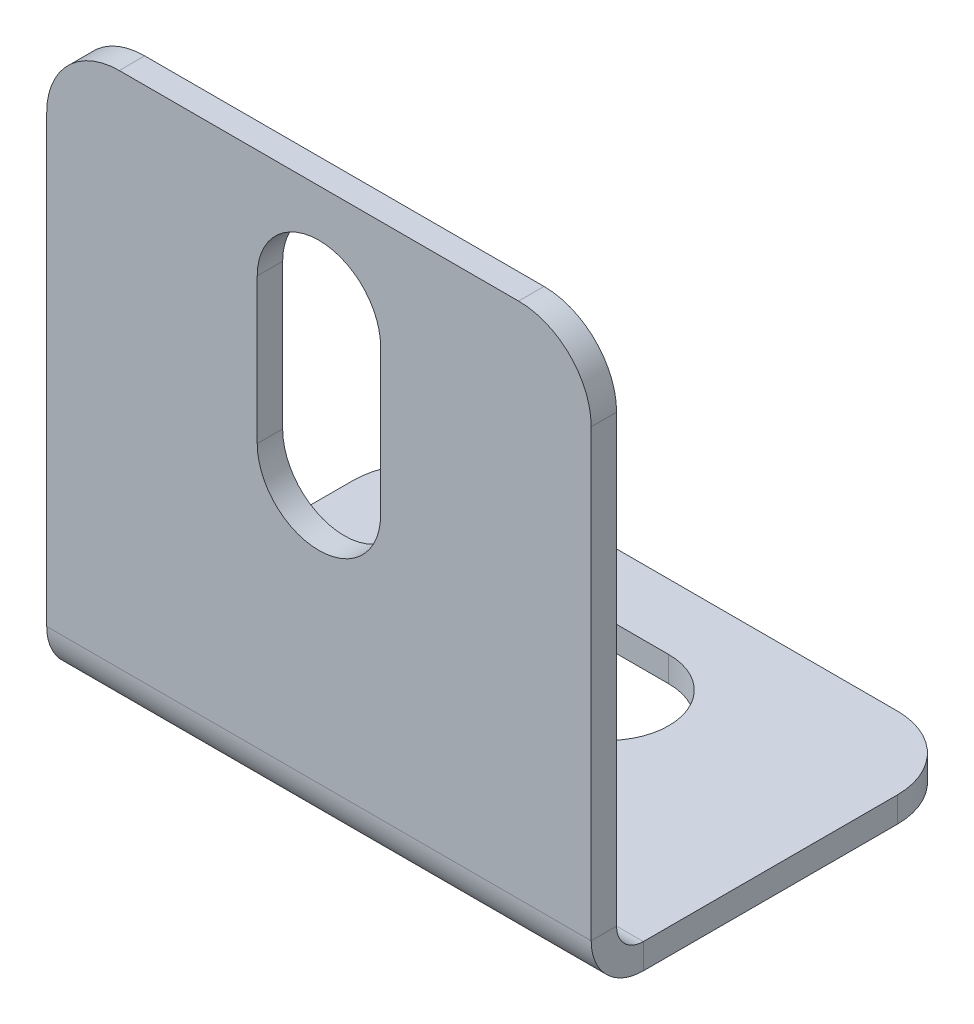
ISO-10303-21;
HEADER;
FILE_DESCRIPTION(('STEP AP214'),'2;1');
FILE_NAME('part.step','',(''),(''),'','','');
FILE_SCHEMA(('AUTOMOTIVE_DESIGN { 1 0 10303 214 1 1 1 1 }'));
ENDSEC;
DATA;
#1=APPLICATION_CONTEXT('core data for automotive mechanical design processes');
#2=APPLICATION_PROTOCOL_DEFINITION('international standard','automotive_design',2000,#1);
#3=PRODUCT_CONTEXT('',#1,'mechanical');
#4=PRODUCT('Part','Part','',(#3));
#5=PRODUCT_RELATED_PRODUCT_CATEGORY('part','',(#4));
#6=PRODUCT_DEFINITION_FORMATION('','',#4);
#7=PRODUCT_DEFINITION_CONTEXT('part definition',#1,'design');
#8=PRODUCT_DEFINITION('design','',#6,#7);
#9=PRODUCT_DEFINITION_SHAPE('','',#8);
#10=(LENGTH_UNIT() NAMED_UNIT(*) SI_UNIT(.MILLI.,.METRE.));
#11=(NAMED_UNIT(*) PLANE_ANGLE_UNIT() SI_UNIT($,.RADIAN.));
#12=(NAMED_UNIT(*) SI_UNIT($,.STERADIAN.) SOLID_ANGLE_UNIT());
#13=UNCERTAINTY_MEASURE_WITH_UNIT(LENGTH_MEASURE(1.E-05),#10,'distance_accuracy_value','');
#14=(GEOMETRIC_REPRESENTATION_CONTEXT(3) GLOBAL_UNCERTAINTY_ASSIGNED_CONTEXT((#13)) GLOBAL_UNIT_ASSIGNED_CONTEXT((#10,
#11,#12)) REPRESENTATION_CONTEXT('',''));
#15=CARTESIAN_POINT('',(0.,0.,0.));
#16=DIRECTION('',(0.,0.,1.));
#17=DIRECTION('',(1.,0.,0.));
#18=AXIS2_PLACEMENT_3D('',#15,#16,#17);
#19=CARTESIAN_POINT('',(0.,-0.7,0.));
#20=DIRECTION('',(-1.,0.,0.));
#21=DIRECTION('',(0.,0.,1.));
#22=AXIS2_PLACEMENT_3D('',#19,#20,#21);
#23=PLANE('',#22);
#24=DIRECTION('',(0.,0.,1.));
#25=VECTOR('',#24,1.);
#26=CARTESIAN_POINT('',(0.,0.,0.));
#27=LINE('',#26,#25);
#28=CARTESIAN_POINT('',(0.,0.,2.));
#29=VERTEX_POINT('',#28);
#30=CARTESIAN_POINT('',(0.,0.,9.));
#31=VERTEX_POINT('',#30);
#32=EDGE_CURVE('E296',#29,#31,#27,.T.);
#33=ORIENTED_EDGE('',*,*,#32,.F.);
#34=DIRECTION('',(0.,1.,0.));
#35=VECTOR('',#34,1.);
#36=CARTESIAN_POINT('',(0.,-0.7,2.));
#37=LINE('',#36,#35);
#38=CARTESIAN_POINT('',(0.,-0.7,2.));
#39=VERTEX_POINT('',#38);
#40=EDGE_CURVE('E359',#29,#39,#37,.F.);
#41=ORIENTED_EDGE('',*,*,#40,.T.);
#42=DIRECTION('',(0.,0.,1.));
#43=VECTOR('',#42,1.);
#44=CARTESIAN_POINT('',(0.,-0.7,0.));
#45=LINE('',#44,#43);
#46=CARTESIAN_POINT('',(0.,-0.7,9.));
#47=VERTEX_POINT('',#46);
#48=EDGE_CURVE('E305',#39,#47,#45,.T.);
#49=ORIENTED_EDGE('',*,*,#48,.T.);
#50=DIRECTION('',(0.,1.,0.));
#51=VECTOR('',#50,1.);
#52=CARTESIAN_POINT('',(0.,-0.7,9.));
#53=LINE('',#52,#51);
#54=EDGE_CURVE('E317',#47,#31,#53,.T.);
#55=ORIENTED_EDGE('',*,*,#54,.T.);
#56=EDGE_LOOP('',(#33,#41,#49,#55));
#57=FACE_BOUND('',#56,.T.);
#58=ADVANCED_FACE('F59',(#57),#23,.T.);
#59=CARTESIAN_POINT('',(0.,-0.7,0.));
#60=DIRECTION('',(0.,0.,-1.));
#61=DIRECTION('',(-1.,0.,0.));
#62=AXIS2_PLACEMENT_3D('',#59,#60,#61);
#63=PLANE('',#62);
#64=DIRECTION('',(-1.,0.,0.));
#65=VECTOR('',#64,1.);
#66=CARTESIAN_POINT('',(0.,-0.7,0.));
#67=LINE('',#66,#65);
#68=CARTESIAN_POINT('',(13.,-0.7,0.));
#69=VERTEX_POINT('',#68);
#70=CARTESIAN_POINT('',(2.,-0.7,0.));
#71=VERTEX_POINT('',#70);
#72=EDGE_CURVE('E314',#69,#71,#67,.T.);
#73=ORIENTED_EDGE('',*,*,#72,.T.);
#74=DIRECTION('',(0.,1.,0.));
#75=VECTOR('',#74,1.);
#76=CARTESIAN_POINT('',(2.,-0.7,0.));
#77=LINE('',#76,#75);
#78=CARTESIAN_POINT('',(2.,0.,0.));
#79=VERTEX_POINT('',#78);
#80=EDGE_CURVE('E352',#71,#79,#77,.T.);
#81=ORIENTED_EDGE('',*,*,#80,.T.);
#82=DIRECTION('',(-1.,0.,0.));
#83=VECTOR('',#82,1.);
#84=CARTESIAN_POINT('',(0.,0.,0.));
#85=LINE('',#84,#83);
#86=CARTESIAN_POINT('',(13.,0.,0.));
#87=VERTEX_POINT('',#86);
#88=EDGE_CURVE('E308',#87,#79,#85,.T.);
#89=ORIENTED_EDGE('',*,*,#88,.F.);
#90=DIRECTION('',(0.,1.,0.));
#91=VECTOR('',#90,1.);
#92=CARTESIAN_POINT('',(13.,-0.7,0.));
#93=LINE('',#92,#91);
#94=EDGE_CURVE('E350',#87,#69,#93,.F.);
#95=ORIENTED_EDGE('',*,*,#94,.T.);
#96=EDGE_LOOP('',(#73,#81,#89,#95));
#97=FACE_BOUND('',#96,.T.);
#98=ADVANCED_FACE('F373',(#97),#63,.T.);
#99=CARTESIAN_POINT('',(15.,-0.7,0.));
#100=DIRECTION('',(1.,0.,0.));
#101=DIRECTION('',(0.,0.,-1.));
#102=AXIS2_PLACEMENT_3D('',#99,#100,#101);
#103=PLANE('',#102);
#104=DIRECTION('',(0.,0.,-1.));
#105=VECTOR('',#104,1.);
#106=CARTESIAN_POINT('',(15.,-0.7,0.));
#107=LINE('',#106,#105);
#108=CARTESIAN_POINT('',(15.,-0.7,9.));
#109=VERTEX_POINT('',#108);
#110=CARTESIAN_POINT('',(15.,-0.7,2.));
#111=VERTEX_POINT('',#110);
#112=EDGE_CURVE('E311',#109,#111,#107,.T.);
#113=ORIENTED_EDGE('',*,*,#112,.T.);
#114=DIRECTION('',(0.,1.,0.));
#115=VECTOR('',#114,1.);
#116=CARTESIAN_POINT('',(15.,-0.7,2.));
#117=LINE('',#116,#115);
#118=CARTESIAN_POINT('',(15.,0.,2.));
#119=VERTEX_POINT('',#118);
#120=EDGE_CURVE('E13',#111,#119,#117,.T.);
#121=ORIENTED_EDGE('',*,*,#120,.T.);
#122=DIRECTION('',(0.,0.,-1.));
#123=VECTOR('',#122,1.);
#124=CARTESIAN_POINT('',(15.,0.,0.));
#125=LINE('',#124,#123);
#126=CARTESIAN_POINT('',(15.,0.,9.));
#127=VERTEX_POINT('',#126);
#128=EDGE_CURVE('E322',#127,#119,#125,.T.);
#129=ORIENTED_EDGE('',*,*,#128,.F.);
#130=DIRECTION('',(0.,1.,0.));
#131=VECTOR('',#130,1.);
#132=CARTESIAN_POINT('',(15.,-0.7,9.));
#133=LINE('',#132,#131);
#134=EDGE_CURVE('E327',#109,#127,#133,.T.);
#135=ORIENTED_EDGE('',*,*,#134,.F.);
#136=EDGE_LOOP('',(#113,#121,#129,#135));
#137=FACE_BOUND('',#136,.T.);
#138=ADVANCED_FACE('F437',(#137),#103,.T.);
#139=CARTESIAN_POINT('',(0.,-0.7,0.));
#140=DIRECTION('',(0.,1.,0.));
#141=DIRECTION('',(0.,0.,1.));
#142=AXIS2_PLACEMENT_3D('',#139,#140,#141);
#143=PLANE('',#142);
#144=CARTESIAN_POINT('',(8.5,-0.699999999999999,3.5));
#145=DIRECTION('',(0.,1.,0.));
#146=DIRECTION('',(0.,0.,1.));
#147=AXIS2_PLACEMENT_3D('',#144,#145,#146);
#148=CIRCLE('',#147,1.7);
#149=CARTESIAN_POINT('',(8.5,-0.699999999999999,5.2));
#150=VERTEX_POINT('',#149);
#151=CARTESIAN_POINT('',(8.5,-0.699999999999999,1.8));
#152=VERTEX_POINT('',#151);
#153=EDGE_CURVE('E259',#150,#152,#148,.T.);
#154=ORIENTED_EDGE('',*,*,#153,.T.);
#155=DIRECTION('',(-1.,0.,0.));
#156=VECTOR('',#155,1.);
#157=CARTESIAN_POINT('',(0.,-0.7,1.8));
#158=LINE('',#157,#156);
#159=CARTESIAN_POINT('',(6.5,-0.699999999999999,1.8));
#160=VERTEX_POINT('',#159);
#161=EDGE_CURVE('E262',#152,#160,#158,.T.);
#162=ORIENTED_EDGE('',*,*,#161,.T.);
#163=CARTESIAN_POINT('',(6.5,-0.699999999999999,3.5));
#164=DIRECTION('',(0.,1.,0.));
#165=DIRECTION('',(0.,0.,1.));
#166=AXIS2_PLACEMENT_3D('',#163,#164,#165);
#167=CIRCLE('',#166,1.7);
#168=CARTESIAN_POINT('',(6.5,-0.699999999999999,5.2));
#169=VERTEX_POINT('',#168);
#170=EDGE_CURVE('E247',#160,#169,#167,.T.);
#171=ORIENTED_EDGE('',*,*,#170,.T.);
#172=DIRECTION('',(-1.,0.,0.));
#173=VECTOR('',#172,1.);
#174=CARTESIAN_POINT('',(0.,-0.7,5.2));
#175=LINE('',#174,#173);
#176=EDGE_CURVE('E256',#150,#169,#175,.T.);
#177=ORIENTED_EDGE('',*,*,#176,.F.);
#178=EDGE_LOOP('',(#154,#162,#171,#177));
#179=FACE_BOUND('',#178,.T.);
#180=ORIENTED_EDGE('',*,*,#48,.F.);
#181=CARTESIAN_POINT('',(2.,-0.7,2.));
#182=DIRECTION('',(0.,1.,0.));
#183=DIRECTION('',(0.,0.,1.));
#184=AXIS2_PLACEMENT_3D('',#181,#182,#183);
#185=CIRCLE('',#184,2.);
#186=EDGE_CURVE('E67',#39,#71,#185,.F.);
#187=ORIENTED_EDGE('',*,*,#186,.T.);
#188=ORIENTED_EDGE('',*,*,#72,.F.);
#189=CARTESIAN_POINT('',(13.,-0.7,2.));
#190=DIRECTION('',(0.,1.,0.));
#191=DIRECTION('',(0.,0.,1.));
#192=AXIS2_PLACEMENT_3D('',#189,#190,#191);
#193=CIRCLE('',#192,2.);
#194=EDGE_CURVE('E361',#69,#111,#193,.F.);
#195=ORIENTED_EDGE('',*,*,#194,.T.);
#196=ORIENTED_EDGE('',*,*,#112,.F.);
#197=DIRECTION('',(1.,0.,0.));
#198=VECTOR('',#197,1.);
#199=CARTESIAN_POINT('',(0.,-0.7,9.));
#200=LINE('',#199,#198);
#201=EDGE_CURVE('E307',#47,#109,#200,.T.);
#202=ORIENTED_EDGE('',*,*,#201,.F.);
#203=EDGE_LOOP('',(#180,#187,#188,#195,#196,#202));
#204=FACE_BOUND('',#203,.T.);
#205=ADVANCED_FACE('F366',(#179,#204),#143,.F.);
#206=CARTESIAN_POINT('',(0.,0.,0.));
#207=DIRECTION('',(0.,1.,0.));
#208=DIRECTION('',(0.,0.,1.));
#209=AXIS2_PLACEMENT_3D('',#206,#207,#208);
#210=PLANE('',#209);
#211=DIRECTION('',(-1.,0.,0.));
#212=VECTOR('',#211,1.);
#213=CARTESIAN_POINT('',(0.,0.,1.8));
#214=LINE('',#213,#212);
#215=CARTESIAN_POINT('',(8.5,0.,1.8));
#216=VERTEX_POINT('',#215);
#217=CARTESIAN_POINT('',(6.5,0.,1.8));
#218=VERTEX_POINT('',#217);
#219=EDGE_CURVE('E233',#216,#218,#214,.T.);
#220=ORIENTED_EDGE('',*,*,#219,.F.);
#221=CARTESIAN_POINT('',(8.5,0.,3.5));
#222=DIRECTION('',(0.,1.,0.));
#223=DIRECTION('',(0.,0.,1.));
#224=AXIS2_PLACEMENT_3D('',#221,#222,#223);
#225=CIRCLE('',#224,1.7);
#226=CARTESIAN_POINT('',(8.5,0.,5.2));
#227=VERTEX_POINT('',#226);
#228=EDGE_CURVE('E241',#227,#216,#225,.T.);
#229=ORIENTED_EDGE('',*,*,#228,.F.);
#230=DIRECTION('',(-1.,0.,0.));
#231=VECTOR('',#230,1.);
#232=CARTESIAN_POINT('',(0.,0.,5.2));
#233=LINE('',#232,#231);
#234=CARTESIAN_POINT('',(6.5,0.,5.2));
#235=VERTEX_POINT('',#234);
#236=EDGE_CURVE('E238',#227,#235,#233,.T.);
#237=ORIENTED_EDGE('',*,*,#236,.T.);
#238=CARTESIAN_POINT('',(6.5,0.,3.5));
#239=DIRECTION('',(0.,1.,0.));
#240=DIRECTION('',(0.,0.,1.));
#241=AXIS2_PLACEMENT_3D('',#238,#239,#240);
#242=CIRCLE('',#241,1.7);
#243=EDGE_CURVE('E235',#218,#235,#242,.T.);
#244=ORIENTED_EDGE('',*,*,#243,.F.);
#245=EDGE_LOOP('',(#220,#229,#237,#244));
#246=FACE_BOUND('',#245,.T.);
#247=ORIENTED_EDGE('',*,*,#88,.T.);
#248=CARTESIAN_POINT('',(2.,0.,2.));
#249=DIRECTION('',(0.,1.,0.));
#250=DIRECTION('',(0.,0.,1.));
#251=AXIS2_PLACEMENT_3D('',#248,#249,#250);
#252=CIRCLE('',#251,2.);
#253=EDGE_CURVE('E357',#79,#29,#252,.T.);
#254=ORIENTED_EDGE('',*,*,#253,.T.);
#255=ORIENTED_EDGE('',*,*,#32,.T.);
#256=DIRECTION('',(1.,0.,0.));
#257=VECTOR('',#256,1.);
#258=CARTESIAN_POINT('',(0.,0.,9.));
#259=LINE('',#258,#257);
#260=EDGE_CURVE('E319',#31,#127,#259,.T.);
#261=ORIENTED_EDGE('',*,*,#260,.T.);
#262=ORIENTED_EDGE('',*,*,#128,.T.);
#263=CARTESIAN_POINT('',(13.,0.,2.));
#264=DIRECTION('',(0.,1.,0.));
#265=DIRECTION('',(0.,0.,1.));
#266=AXIS2_PLACEMENT_3D('',#263,#264,#265);
#267=CIRCLE('',#266,2.);
#268=EDGE_CURVE('E355',#119,#87,#267,.T.);
#269=ORIENTED_EDGE('',*,*,#268,.T.);
#270=EDGE_LOOP('',(#247,#254,#255,#261,#262,#269));
#271=FACE_BOUND('',#270,.T.);
#272=ADVANCED_FACE('F379',(#246,#271),#210,.T.);
#273=CARTESIAN_POINT('',(0.,0.736599999999997,9.));
#274=DIRECTION('',(-1.,0.,0.));
#275=DIRECTION('',(0.,0.,1.));
#276=AXIS2_PLACEMENT_3D('',#273,#274,#275);
#277=PLANE('',#276);
#278=DIRECTION('',(0.,0.,-1.));
#279=VECTOR('',#278,1.);
#280=CARTESIAN_POINT('',(0.,0.736599999999997,10.4366));
#281=LINE('',#280,#279);
#282=CARTESIAN_POINT('',(0.,0.736599999999997,9.7366));
#283=VERTEX_POINT('',#282);
#284=CARTESIAN_POINT('',(0.,0.736599999999997,10.4366));
#285=VERTEX_POINT('',#284);
#286=EDGE_CURVE('E265',#283,#285,#281,.F.);
#287=ORIENTED_EDGE('',*,*,#286,.F.);
#288=CARTESIAN_POINT('',(0.,0.736599999999997,9.));
#289=DIRECTION('',(1.,0.,0.));
#290=DIRECTION('',(0.,0.,-1.));
#291=AXIS2_PLACEMENT_3D('',#288,#289,#290);
#292=CIRCLE('',#291,0.736599999999997);
#293=EDGE_CURVE('E300',#31,#283,#292,.F.);
#294=ORIENTED_EDGE('',*,*,#293,.F.);
#295=ORIENTED_EDGE('',*,*,#54,.F.);
#296=CARTESIAN_POINT('',(0.,0.736599999999997,9.));
#297=DIRECTION('',(1.,0.,0.));
#298=DIRECTION('',(0.,0.,-1.));
#299=AXIS2_PLACEMENT_3D('',#296,#297,#298);
#300=CIRCLE('',#299,1.4366);
#301=EDGE_CURVE('E293',#47,#285,#300,.F.);
#302=ORIENTED_EDGE('',*,*,#301,.T.);
#303=EDGE_LOOP('',(#287,#294,#295,#302));
#304=FACE_BOUND('',#303,.T.);
#305=ADVANCED_FACE('F391',(#304),#277,.T.);
#306=CARTESIAN_POINT('',(15.,0.736599999999997,9.));
#307=DIRECTION('',(-1.,0.,0.));
#308=DIRECTION('',(0.,0.,1.));
#309=AXIS2_PLACEMENT_3D('',#306,#307,#308);
#310=PLANE('',#309);
#311=CARTESIAN_POINT('',(15.,0.736599999999997,9.));
#312=DIRECTION('',(1.,0.,0.));
#313=DIRECTION('',(0.,0.,-1.));
#314=AXIS2_PLACEMENT_3D('',#311,#312,#313);
#315=CIRCLE('',#314,0.736599999999997);
#316=CARTESIAN_POINT('',(15.,0.736599999999997,9.7366));
#317=VERTEX_POINT('',#316);
#318=EDGE_CURVE('E269',#317,#127,#315,.T.);
#319=ORIENTED_EDGE('',*,*,#318,.F.);
#320=DIRECTION('',(0.,0.,-1.));
#321=VECTOR('',#320,1.);
#322=CARTESIAN_POINT('',(15.,0.736599999999997,9.7366));
#323=LINE('',#322,#321);
#324=CARTESIAN_POINT('',(15.,0.736599999999997,10.4366));
#325=VERTEX_POINT('',#324);
#326=EDGE_CURVE('E286',#317,#325,#323,.F.);
#327=ORIENTED_EDGE('',*,*,#326,.T.);
#328=CARTESIAN_POINT('',(15.,0.736599999999997,9.));
#329=DIRECTION('',(1.,0.,0.));
#330=DIRECTION('',(0.,0.,-1.));
#331=AXIS2_PLACEMENT_3D('',#328,#329,#330);
#332=CIRCLE('',#331,1.4366);
#333=EDGE_CURVE('E297',#325,#109,#332,.T.);
#334=ORIENTED_EDGE('',*,*,#333,.T.);
#335=ORIENTED_EDGE('',*,*,#134,.T.);
#336=EDGE_LOOP('',(#319,#327,#334,#335));
#337=FACE_BOUND('',#336,.T.);
#338=ADVANCED_FACE('F401',(#337),#310,.F.);
#339=CARTESIAN_POINT('',(15.,0.736599999999997,9.));
#340=DIRECTION('',(1.,0.,0.));
#341=DIRECTION('',(0.,0.,1.));
#342=AXIS2_PLACEMENT_3D('',#339,#340,#341);
#343=CYLINDRICAL_SURFACE('',#342,1.4366);
#344=ORIENTED_EDGE('',*,*,#201,.T.);
#345=ORIENTED_EDGE('',*,*,#333,.F.);
#346=DIRECTION('',(1.,0.,0.));
#347=VECTOR('',#346,1.);
#348=CARTESIAN_POINT('',(0.,0.736599999999997,10.4366));
#349=LINE('',#348,#347);
#350=EDGE_CURVE('E283',#325,#285,#349,.F.);
#351=ORIENTED_EDGE('',*,*,#350,.T.);
#352=ORIENTED_EDGE('',*,*,#301,.F.);
#353=EDGE_LOOP('',(#344,#345,#351,#352));
#354=FACE_BOUND('',#353,.T.);
#355=ADVANCED_FACE('F451',(#354),#343,.T.);
#356=CARTESIAN_POINT('',(15.,0.736599999999997,9.));
#357=DIRECTION('',(1.,0.,0.));
#358=DIRECTION('',(0.,0.,1.));
#359=AXIS2_PLACEMENT_3D('',#356,#357,#358);
#360=CYLINDRICAL_SURFACE('',#359,0.736599999999997);
#361=ORIENTED_EDGE('',*,*,#260,.F.);
#362=ORIENTED_EDGE('',*,*,#293,.T.);
#363=DIRECTION('',(1.,0.,0.));
#364=VECTOR('',#363,1.);
#365=CARTESIAN_POINT('',(0.,0.736599999999997,9.7366));
#366=LINE('',#365,#364);
#367=EDGE_CURVE('E289',#283,#317,#366,.T.);
#368=ORIENTED_EDGE('',*,*,#367,.T.);
#369=ORIENTED_EDGE('',*,*,#318,.T.);
#370=EDGE_LOOP('',(#361,#362,#368,#369));
#371=FACE_BOUND('',#370,.T.);
#372=ADVANCED_FACE('F387',(#371),#360,.F.);
#373=CARTESIAN_POINT('',(0.,0.,10.4366));
#374=DIRECTION('',(1.,0.,0.));
#375=DIRECTION('',(0.,1.,0.));
#376=AXIS2_PLACEMENT_3D('',#373,#374,#375);
#377=PLANE('',#376);
#378=DIRECTION('',(0.,-1.,0.));
#379=VECTOR('',#378,1.);
#380=CARTESIAN_POINT('',(0.,0.,10.4366));
#381=LINE('',#380,#379);
#382=CARTESIAN_POINT('',(0.,13.,10.4366));
#383=VERTEX_POINT('',#382);
#384=EDGE_CURVE('E273',#383,#285,#381,.T.);
#385=ORIENTED_EDGE('',*,*,#384,.F.);
#386=DIRECTION('',(0.,0.,-1.));
#387=VECTOR('',#386,1.);
#388=CARTESIAN_POINT('',(0.,13.,10.4366));
#389=LINE('',#388,#387);
#390=CARTESIAN_POINT('',(0.,13.,9.7366));
#391=VERTEX_POINT('',#390);
#392=EDGE_CURVE('E330',#383,#391,#389,.T.);
#393=ORIENTED_EDGE('',*,*,#392,.T.);
#394=DIRECTION('',(0.,1.,0.));
#395=VECTOR('',#394,1.);
#396=CARTESIAN_POINT('',(0.,0.,9.7366));
#397=LINE('',#396,#395);
#398=EDGE_CURVE('E281',#391,#283,#397,.F.);
#399=ORIENTED_EDGE('',*,*,#398,.T.);
#400=ORIENTED_EDGE('',*,*,#286,.T.);
#401=EDGE_LOOP('',(#385,#393,#399,#400));
#402=FACE_BOUND('',#401,.T.);
#403=ADVANCED_FACE('F394',(#402),#377,.F.);
#404=CARTESIAN_POINT('',(15.,15.,10.4366));
#405=DIRECTION('',(-1.,0.,0.));
#406=DIRECTION('',(0.,0.,1.));
#407=AXIS2_PLACEMENT_3D('',#404,#405,#406);
#408=PLANE('',#407);
#409=DIRECTION('',(0.,-1.,0.));
#410=VECTOR('',#409,1.);
#411=CARTESIAN_POINT('',(15.,15.,9.7366));
#412=LINE('',#411,#410);
#413=CARTESIAN_POINT('',(15.,13.,9.7366));
#414=VERTEX_POINT('',#413);
#415=EDGE_CURVE('E278',#317,#414,#412,.F.);
#416=ORIENTED_EDGE('',*,*,#415,.T.);
#417=DIRECTION('',(0.,0.,-1.));
#418=VECTOR('',#417,1.);
#419=CARTESIAN_POINT('',(15.,13.,10.4366));
#420=LINE('',#419,#418);
#421=CARTESIAN_POINT('',(15.,13.,10.4366));
#422=VERTEX_POINT('',#421);
#423=EDGE_CURVE('E348',#414,#422,#420,.F.);
#424=ORIENTED_EDGE('',*,*,#423,.T.);
#425=DIRECTION('',(0.,1.,0.));
#426=VECTOR('',#425,1.);
#427=CARTESIAN_POINT('',(15.,0.,10.4366));
#428=LINE('',#427,#426);
#429=EDGE_CURVE('E270',#325,#422,#428,.T.);
#430=ORIENTED_EDGE('',*,*,#429,.F.);
#431=ORIENTED_EDGE('',*,*,#326,.F.);
#432=EDGE_LOOP('',(#416,#424,#430,#431));
#433=FACE_BOUND('',#432,.T.);
#434=ADVANCED_FACE('F406',(#433),#408,.F.);
#435=CARTESIAN_POINT('',(0.,0.,10.4366));
#436=DIRECTION('',(0.,0.,-1.));
#437=DIRECTION('',(-1.,0.,0.));
#438=AXIS2_PLACEMENT_3D('',#435,#436,#437);
#439=PLANE('',#438);
#440=DIRECTION('',(0.,1.,0.));
#441=VECTOR('',#440,1.);
#442=CARTESIAN_POINT('',(5.8,0.,10.4366));
#443=LINE('',#442,#441);
#444=CARTESIAN_POINT('',(5.8,8.,10.4366));
#445=VERTEX_POINT('',#444);
#446=CARTESIAN_POINT('',(5.8,12.,10.4366));
#447=VERTEX_POINT('',#446);
#448=EDGE_CURVE('E227',#445,#447,#443,.T.);
#449=ORIENTED_EDGE('',*,*,#448,.T.);
#450=CARTESIAN_POINT('',(7.5,12.,10.4366));
#451=DIRECTION('',(0.,0.,-1.));
#452=DIRECTION('',(-1.,0.,0.));
#453=AXIS2_PLACEMENT_3D('',#450,#451,#452);
#454=CIRCLE('',#453,1.7);
#455=CARTESIAN_POINT('',(9.2,12.,10.4366));
#456=VERTEX_POINT('',#455);
#457=EDGE_CURVE('E230',#447,#456,#454,.T.);
#458=ORIENTED_EDGE('',*,*,#457,.T.);
#459=DIRECTION('',(0.,-1.,0.));
#460=VECTOR('',#459,1.);
#461=CARTESIAN_POINT('',(9.2,0.,10.4366));
#462=LINE('',#461,#460);
#463=CARTESIAN_POINT('',(9.2,8.,10.4366));
#464=VERTEX_POINT('',#463);
#465=EDGE_CURVE('E222',#456,#464,#462,.T.);
#466=ORIENTED_EDGE('',*,*,#465,.T.);
#467=CARTESIAN_POINT('',(7.5,8.,10.4366));
#468=DIRECTION('',(0.,0.,-1.));
#469=DIRECTION('',(-1.,0.,0.));
#470=AXIS2_PLACEMENT_3D('',#467,#468,#469);
#471=CIRCLE('',#470,1.7);
#472=EDGE_CURVE('E202',#464,#445,#471,.T.);
#473=ORIENTED_EDGE('',*,*,#472,.T.);
#474=EDGE_LOOP('',(#449,#458,#466,#473));
#475=FACE_BOUND('',#474,.T.);
#476=DIRECTION('',(-1.,0.,0.));
#477=VECTOR('',#476,1.);
#478=CARTESIAN_POINT('',(0.,15.,10.4366));
#479=LINE('',#478,#477);
#480=CARTESIAN_POINT('',(13.,15.,10.4366));
#481=VERTEX_POINT('',#480);
#482=CARTESIAN_POINT('',(2.,15.,10.4366));
#483=VERTEX_POINT('',#482);
#484=EDGE_CURVE('E266',#481,#483,#479,.T.);
#485=ORIENTED_EDGE('',*,*,#484,.T.);
#486=CARTESIAN_POINT('',(2.,13.,10.4366));
#487=DIRECTION('',(0.,0.,-1.));
#488=DIRECTION('',(-1.,0.,0.));
#489=AXIS2_PLACEMENT_3D('',#486,#487,#488);
#490=CIRCLE('',#489,2.);
#491=EDGE_CURVE('E346',#483,#383,#490,.F.);
#492=ORIENTED_EDGE('',*,*,#491,.T.);
#493=ORIENTED_EDGE('',*,*,#384,.T.);
#494=ORIENTED_EDGE('',*,*,#350,.F.);
#495=ORIENTED_EDGE('',*,*,#429,.T.);
#496=CARTESIAN_POINT('',(13.,13.,10.4366));
#497=DIRECTION('',(0.,0.,-1.));
#498=DIRECTION('',(-1.,0.,0.));
#499=AXIS2_PLACEMENT_3D('',#496,#497,#498);
#500=CIRCLE('',#499,2.);
#501=EDGE_CURVE('E344',#422,#481,#500,.F.);
#502=ORIENTED_EDGE('',*,*,#501,.T.);
#503=EDGE_LOOP('',(#485,#492,#493,#494,#495,#502));
#504=FACE_BOUND('',#503,.T.);
#505=ADVANCED_FACE('F410',(#475,#504),#439,.F.);
#506=CARTESIAN_POINT('',(0.,0.,9.7366));
#507=DIRECTION('',(0.,0.,-1.));
#508=DIRECTION('',(-1.,0.,0.));
#509=AXIS2_PLACEMENT_3D('',#506,#507,#508);
#510=PLANE('',#509);
#511=CARTESIAN_POINT('',(7.5,12.,9.7366));
#512=DIRECTION('',(0.,0.,-1.));
#513=DIRECTION('',(-1.,0.,0.));
#514=AXIS2_PLACEMENT_3D('',#511,#512,#513);
#515=CIRCLE('',#514,1.7);
#516=CARTESIAN_POINT('',(5.8,12.,9.7366));
#517=VERTEX_POINT('',#516);
#518=CARTESIAN_POINT('',(9.2,12.,9.7366));
#519=VERTEX_POINT('',#518);
#520=EDGE_CURVE('E82',#517,#519,#515,.T.);
#521=ORIENTED_EDGE('',*,*,#520,.F.);
#522=DIRECTION('',(0.,1.,0.));
#523=VECTOR('',#522,1.);
#524=CARTESIAN_POINT('',(5.8,12.,9.7366));
#525=LINE('',#524,#523);
#526=CARTESIAN_POINT('',(5.8,8.,9.7366));
#527=VERTEX_POINT('',#526);
#528=EDGE_CURVE('E215',#527,#517,#525,.T.);
#529=ORIENTED_EDGE('',*,*,#528,.F.);
#530=CARTESIAN_POINT('',(7.5,8.,9.7366));
#531=DIRECTION('',(0.,0.,-1.));
#532=DIRECTION('',(-1.,0.,0.));
#533=AXIS2_PLACEMENT_3D('',#530,#531,#532);
#534=CIRCLE('',#533,1.7);
#535=CARTESIAN_POINT('',(9.2,8.,9.7366));
#536=VERTEX_POINT('',#535);
#537=EDGE_CURVE('E199',#536,#527,#534,.T.);
#538=ORIENTED_EDGE('',*,*,#537,.F.);
#539=DIRECTION('',(0.,-1.,0.));
#540=VECTOR('',#539,1.);
#541=CARTESIAN_POINT('',(9.2,12.,9.7366));
#542=LINE('',#541,#540);
#543=EDGE_CURVE('E208',#519,#536,#542,.T.);
#544=ORIENTED_EDGE('',*,*,#543,.F.);
#545=EDGE_LOOP('',(#521,#529,#538,#544));
#546=FACE_BOUND('',#545,.T.);
#547=ORIENTED_EDGE('',*,*,#398,.F.);
#548=CARTESIAN_POINT('',(2.,13.,9.7366));
#549=DIRECTION('',(0.,0.,-1.));
#550=DIRECTION('',(-1.,0.,0.));
#551=AXIS2_PLACEMENT_3D('',#548,#549,#550);
#552=CIRCLE('',#551,2.);
#553=CARTESIAN_POINT('',(2.,15.,9.7366));
#554=VERTEX_POINT('',#553);
#555=EDGE_CURVE('E337',#391,#554,#552,.T.);
#556=ORIENTED_EDGE('',*,*,#555,.T.);
#557=DIRECTION('',(1.,0.,0.));
#558=VECTOR('',#557,1.);
#559=CARTESIAN_POINT('',(0.,15.,9.7366));
#560=LINE('',#559,#558);
#561=CARTESIAN_POINT('',(13.,15.,9.7366));
#562=VERTEX_POINT('',#561);
#563=EDGE_CURVE('E275',#562,#554,#560,.F.);
#564=ORIENTED_EDGE('',*,*,#563,.F.);
#565=CARTESIAN_POINT('',(13.,13.,9.7366));
#566=DIRECTION('',(0.,0.,-1.));
#567=DIRECTION('',(-1.,0.,0.));
#568=AXIS2_PLACEMENT_3D('',#565,#566,#567);
#569=CIRCLE('',#568,2.);
#570=EDGE_CURVE('E335',#562,#414,#569,.T.);
#571=ORIENTED_EDGE('',*,*,#570,.T.);
#572=ORIENTED_EDGE('',*,*,#415,.F.);
#573=ORIENTED_EDGE('',*,*,#367,.F.);
#574=EDGE_LOOP('',(#547,#556,#564,#571,#572,#573));
#575=FACE_BOUND('',#574,.T.);
#576=ADVANCED_FACE('F212',(#546,#575),#510,.T.);
#577=CARTESIAN_POINT('',(0.,15.,10.4366));
#578=DIRECTION('',(0.,-1.,0.));
#579=DIRECTION('',(0.,0.,-1.));
#580=AXIS2_PLACEMENT_3D('',#577,#578,#579);
#581=PLANE('',#580);
#582=ORIENTED_EDGE('',*,*,#563,.T.);
#583=DIRECTION('',(0.,0.,-1.));
#584=VECTOR('',#583,1.);
#585=CARTESIAN_POINT('',(2.,15.,10.4366));
#586=LINE('',#585,#584);
#587=EDGE_CURVE('E342',#554,#483,#586,.F.);
#588=ORIENTED_EDGE('',*,*,#587,.T.);
#589=ORIENTED_EDGE('',*,*,#484,.F.);
#590=DIRECTION('',(0.,0.,-1.));
#591=VECTOR('',#590,1.);
#592=CARTESIAN_POINT('',(13.,15.,10.4366));
#593=LINE('',#592,#591);
#594=EDGE_CURVE('E339',#481,#562,#593,.T.);
#595=ORIENTED_EDGE('',*,*,#594,.T.);
#596=EDGE_LOOP('',(#582,#588,#589,#595));
#597=FACE_BOUND('',#596,.T.);
#598=ADVANCED_FACE('F416',(#597),#581,.F.);
#599=CARTESIAN_POINT('',(0.,-10.,1.8));
#600=DIRECTION('',(0.,0.,-1.));
#601=DIRECTION('',(-1.,0.,0.));
#602=AXIS2_PLACEMENT_3D('',#599,#600,#601);
#603=PLANE('',#602);
#604=DIRECTION('',(0.,1.,0.));
#605=VECTOR('',#604,1.);
#606=CARTESIAN_POINT('',(8.5,-10.,1.8));
#607=LINE('',#606,#605);
#608=EDGE_CURVE('E245',#152,#216,#607,.T.);
#609=ORIENTED_EDGE('',*,*,#608,.T.);
#610=ORIENTED_EDGE('',*,*,#219,.T.);
#611=DIRECTION('',(0.,1.,0.));
#612=VECTOR('',#611,1.);
#613=CARTESIAN_POINT('',(6.5,-10.,1.8));
#614=LINE('',#613,#612);
#615=EDGE_CURVE('E244',#160,#218,#614,.T.);
#616=ORIENTED_EDGE('',*,*,#615,.F.);
#617=ORIENTED_EDGE('',*,*,#161,.F.);
#618=EDGE_LOOP('',(#609,#610,#616,#617));
#619=FACE_BOUND('',#618,.T.);
#620=ADVANCED_FACE('F465',(#619),#603,.F.);
#621=CARTESIAN_POINT('',(8.5,-10.,3.5));
#622=DIRECTION('',(0.,1.,0.));
#623=DIRECTION('',(0.,0.,1.));
#624=AXIS2_PLACEMENT_3D('',#621,#622,#623);
#625=CYLINDRICAL_SURFACE('',#624,1.7);
#626=DIRECTION('',(0.,1.,0.));
#627=VECTOR('',#626,1.);
#628=CARTESIAN_POINT('',(8.5,-10.,5.2));
#629=LINE('',#628,#627);
#630=EDGE_CURVE('E248',#150,#227,#629,.T.);
#631=ORIENTED_EDGE('',*,*,#630,.T.);
#632=ORIENTED_EDGE('',*,*,#228,.T.);
#633=ORIENTED_EDGE('',*,*,#608,.F.);
#634=ORIENTED_EDGE('',*,*,#153,.F.);
#635=EDGE_LOOP('',(#631,#632,#633,#634));
#636=FACE_BOUND('',#635,.T.);
#637=ADVANCED_FACE('F472',(#636),#625,.F.);
#638=CARTESIAN_POINT('',(0.,-10.,5.2));
#639=DIRECTION('',(0.,0.,-1.));
#640=DIRECTION('',(-1.,0.,0.));
#641=AXIS2_PLACEMENT_3D('',#638,#639,#640);
#642=PLANE('',#641);
#643=ORIENTED_EDGE('',*,*,#176,.T.);
#644=DIRECTION('',(0.,1.,0.));
#645=VECTOR('',#644,1.);
#646=CARTESIAN_POINT('',(6.5,-10.,5.2));
#647=LINE('',#646,#645);
#648=EDGE_CURVE('E250',#169,#235,#647,.T.);
#649=ORIENTED_EDGE('',*,*,#648,.T.);
#650=ORIENTED_EDGE('',*,*,#236,.F.);
#651=ORIENTED_EDGE('',*,*,#630,.F.);
#652=EDGE_LOOP('',(#643,#649,#650,#651));
#653=FACE_BOUND('',#652,.T.);
#654=ADVANCED_FACE('F429',(#653),#642,.T.);
#655=CARTESIAN_POINT('',(6.5,-10.,3.5));
#656=DIRECTION('',(0.,1.,0.));
#657=DIRECTION('',(0.,0.,1.));
#658=AXIS2_PLACEMENT_3D('',#655,#656,#657);
#659=CYLINDRICAL_SURFACE('',#658,1.7);
#660=ORIENTED_EDGE('',*,*,#615,.T.);
#661=ORIENTED_EDGE('',*,*,#243,.T.);
#662=ORIENTED_EDGE('',*,*,#648,.F.);
#663=ORIENTED_EDGE('',*,*,#170,.F.);
#664=EDGE_LOOP('',(#660,#661,#662,#663));
#665=FACE_BOUND('',#664,.T.);
#666=ADVANCED_FACE('F422',(#665),#659,.F.);
#667=CARTESIAN_POINT('',(2.,13.,10.4366));
#668=DIRECTION('',(0.,0.,-1.));
#669=DIRECTION('',(-1.,0.,0.));
#670=AXIS2_PLACEMENT_3D('',#667,#668,#669);
#671=CYLINDRICAL_SURFACE('',#670,2.);
#672=ORIENTED_EDGE('',*,*,#491,.F.);
#673=ORIENTED_EDGE('',*,*,#587,.F.);
#674=ORIENTED_EDGE('',*,*,#555,.F.);
#675=ORIENTED_EDGE('',*,*,#392,.F.);
#676=EDGE_LOOP('',(#672,#673,#674,#675));
#677=FACE_BOUND('',#676,.T.);
#678=ADVANCED_FACE('F420',(#677),#671,.T.);
#679=CARTESIAN_POINT('',(13.,13.,10.4366));
#680=DIRECTION('',(0.,0.,-1.));
#681=DIRECTION('',(-1.,0.,0.));
#682=AXIS2_PLACEMENT_3D('',#679,#680,#681);
#683=CYLINDRICAL_SURFACE('',#682,2.);
#684=ORIENTED_EDGE('',*,*,#501,.F.);
#685=ORIENTED_EDGE('',*,*,#423,.F.);
#686=ORIENTED_EDGE('',*,*,#570,.F.);
#687=ORIENTED_EDGE('',*,*,#594,.F.);
#688=EDGE_LOOP('',(#684,#685,#686,#687));
#689=FACE_BOUND('',#688,.T.);
#690=ADVANCED_FACE('F414',(#689),#683,.T.);
#691=CARTESIAN_POINT('',(2.,-0.7,2.));
#692=DIRECTION('',(0.,1.,0.));
#693=DIRECTION('',(0.,0.,1.));
#694=AXIS2_PLACEMENT_3D('',#691,#692,#693);
#695=CYLINDRICAL_SURFACE('',#694,2.);
#696=ORIENTED_EDGE('',*,*,#186,.F.);
#697=ORIENTED_EDGE('',*,*,#40,.F.);
#698=ORIENTED_EDGE('',*,*,#253,.F.);
#699=ORIENTED_EDGE('',*,*,#80,.F.);
#700=EDGE_LOOP('',(#696,#697,#698,#699));
#701=FACE_BOUND('',#700,.T.);
#702=ADVANCED_FACE('F376',(#701),#695,.T.);
#703=CARTESIAN_POINT('',(13.,-0.7,2.));
#704=DIRECTION('',(0.,1.,0.));
#705=DIRECTION('',(0.,0.,1.));
#706=AXIS2_PLACEMENT_3D('',#703,#704,#705);
#707=CYLINDRICAL_SURFACE('',#706,2.);
#708=ORIENTED_EDGE('',*,*,#194,.F.);
#709=ORIENTED_EDGE('',*,*,#94,.F.);
#710=ORIENTED_EDGE('',*,*,#268,.F.);
#711=ORIENTED_EDGE('',*,*,#120,.F.);
#712=EDGE_LOOP('',(#708,#709,#710,#711));
#713=FACE_BOUND('',#712,.T.);
#714=ADVANCED_FACE('F61',(#713),#707,.T.);
#715=CARTESIAN_POINT('',(7.5,12.,19.7366));
#716=DIRECTION('',(0.,0.,-1.));
#717=DIRECTION('',(-1.,0.,0.));
#718=AXIS2_PLACEMENT_3D('',#715,#716,#717);
#719=CYLINDRICAL_SURFACE('',#718,1.7);
#720=DIRECTION('',(0.,0.,-1.));
#721=VECTOR('',#720,1.);
#722=CARTESIAN_POINT('',(5.8,12.,19.7366));
#723=LINE('',#722,#721);
#724=EDGE_CURVE('E220',#447,#517,#723,.T.);
#725=ORIENTED_EDGE('',*,*,#724,.T.);
#726=ORIENTED_EDGE('',*,*,#520,.T.);
#727=DIRECTION('',(0.,0.,-1.));
#728=VECTOR('',#727,1.);
#729=CARTESIAN_POINT('',(9.2,12.,19.7366));
#730=LINE('',#729,#728);
#731=EDGE_CURVE('E205',#456,#519,#730,.T.);
#732=ORIENTED_EDGE('',*,*,#731,.F.);
#733=ORIENTED_EDGE('',*,*,#457,.F.);
#734=EDGE_LOOP('',(#725,#726,#732,#733));
#735=FACE_BOUND('',#734,.T.);
#736=ADVANCED_FACE('F481',(#735),#719,.F.);
#737=CARTESIAN_POINT('',(5.8,12.,19.7366));
#738=DIRECTION('',(-1.,0.,0.));
#739=DIRECTION('',(0.,-1.,0.));
#740=AXIS2_PLACEMENT_3D('',#737,#738,#739);
#741=PLANE('',#740);
#742=DIRECTION('',(0.,0.,-1.));
#743=VECTOR('',#742,1.);
#744=CARTESIAN_POINT('',(5.8,8.,19.7366));
#745=LINE('',#744,#743);
#746=EDGE_CURVE('E204',#445,#527,#745,.T.);
#747=ORIENTED_EDGE('',*,*,#746,.T.);
#748=ORIENTED_EDGE('',*,*,#528,.T.);
#749=ORIENTED_EDGE('',*,*,#724,.F.);
#750=ORIENTED_EDGE('',*,*,#448,.F.);
#751=EDGE_LOOP('',(#747,#748,#749,#750));
#752=FACE_BOUND('',#751,.T.);
#753=ADVANCED_FACE('F484',(#752),#741,.F.);
#754=CARTESIAN_POINT('',(7.5,8.,19.7366));
#755=DIRECTION('',(0.,0.,-1.));
#756=DIRECTION('',(-1.,0.,0.));
#757=AXIS2_PLACEMENT_3D('',#754,#755,#756);
#758=CYLINDRICAL_SURFACE('',#757,1.7);
#759=DIRECTION('',(0.,0.,-1.));
#760=VECTOR('',#759,1.);
#761=CARTESIAN_POINT('',(9.2,8.,19.7366));
#762=LINE('',#761,#760);
#763=EDGE_CURVE('E74',#464,#536,#762,.T.);
#764=ORIENTED_EDGE('',*,*,#763,.T.);
#765=ORIENTED_EDGE('',*,*,#537,.T.);
#766=ORIENTED_EDGE('',*,*,#746,.F.);
#767=ORIENTED_EDGE('',*,*,#472,.F.);
#768=EDGE_LOOP('',(#764,#765,#766,#767));
#769=FACE_BOUND('',#768,.T.);
#770=ADVANCED_FACE('F196',(#769),#758,.F.);
#771=CARTESIAN_POINT('',(9.2,12.,19.7366));
#772=DIRECTION('',(1.,0.,0.));
#773=DIRECTION('',(0.,0.,-1.));
#774=AXIS2_PLACEMENT_3D('',#771,#772,#773);
#775=PLANE('',#774);
#776=ORIENTED_EDGE('',*,*,#731,.T.);
#777=ORIENTED_EDGE('',*,*,#543,.T.);
#778=ORIENTED_EDGE('',*,*,#763,.F.);
#779=ORIENTED_EDGE('',*,*,#465,.F.);
#780=EDGE_LOOP('',(#776,#777,#778,#779));
#781=FACE_BOUND('',#780,.T.);
#782=ADVANCED_FACE('F209',(#781),#775,.F.);
#783=CLOSED_SHELL('',(#58,#98,#138,#205,#272,#305,#338,#355,#372,#403,#434,#505,#576,#598,#620,
#637,#654,#666,#678,#690,#702,#714,#736,#753,#770,#782));
#784=MANIFOLD_SOLID_BREP('B2',#783);
#785=ADVANCED_BREP_SHAPE_REPRESENTATION('',(#18,#784),#14);
#786=SHAPE_DEFINITION_REPRESENTATION(#9,#785);
ENDSEC;
END-ISO-10303-21;
